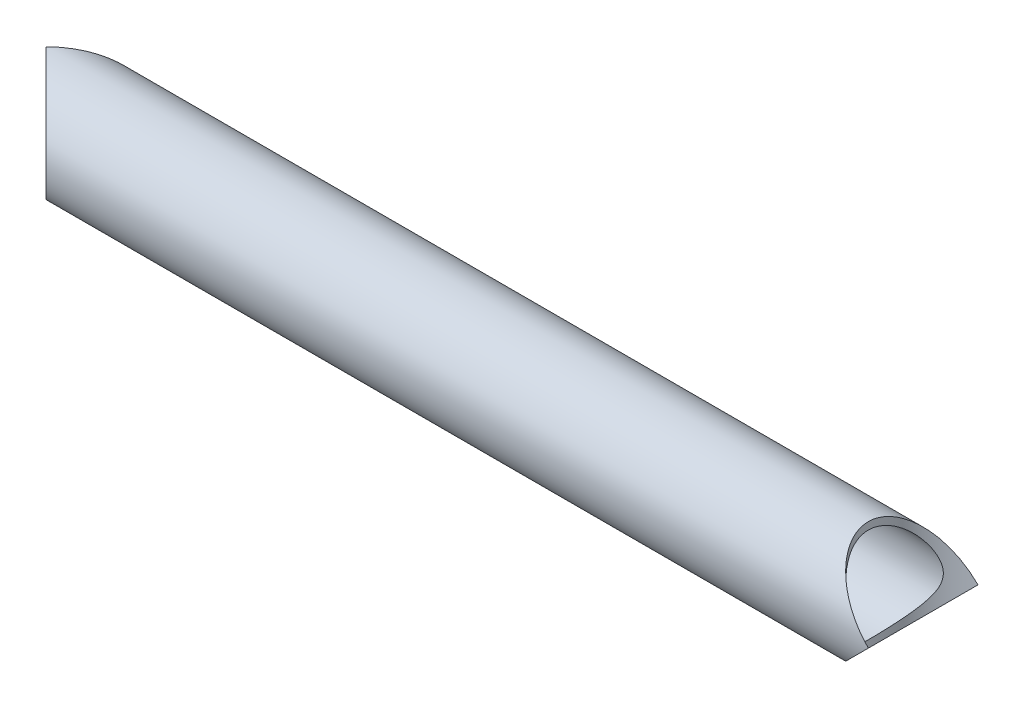
ISO-10303-21;
HEADER;
FILE_DESCRIPTION(('STEP AP214'),'2;1');
FILE_NAME('part.step','',(''),(''),'','','');
FILE_SCHEMA(('AUTOMOTIVE_DESIGN { 1 0 10303 214 1 1 1 1 }'));
ENDSEC;
DATA;
#1=APPLICATION_CONTEXT('core data for automotive mechanical design processes');
#2=APPLICATION_PROTOCOL_DEFINITION('international standard','automotive_design',2000,#1);
#3=PRODUCT_CONTEXT('',#1,'mechanical');
#4=PRODUCT('Part','Part','',(#3));
#5=PRODUCT_RELATED_PRODUCT_CATEGORY('part','',(#4));
#6=PRODUCT_DEFINITION_FORMATION('','',#4);
#7=PRODUCT_DEFINITION_CONTEXT('part definition',#1,'design');
#8=PRODUCT_DEFINITION('design','',#6,#7);
#9=PRODUCT_DEFINITION_SHAPE('','',#8);
#10=(LENGTH_UNIT() NAMED_UNIT(*) SI_UNIT(.MILLI.,.METRE.));
#11=(NAMED_UNIT(*) PLANE_ANGLE_UNIT() SI_UNIT($,.RADIAN.));
#12=(NAMED_UNIT(*) SI_UNIT($,.STERADIAN.) SOLID_ANGLE_UNIT());
#13=UNCERTAINTY_MEASURE_WITH_UNIT(LENGTH_MEASURE(1.E-05),#10,'distance_accuracy_value','');
#14=(GEOMETRIC_REPRESENTATION_CONTEXT(3) GLOBAL_UNCERTAINTY_ASSIGNED_CONTEXT((#13)) GLOBAL_UNIT_ASSIGNED_CONTEXT((#10,
#11,#12)) REPRESENTATION_CONTEXT('',''));
#15=CARTESIAN_POINT('',(0.,0.,0.));
#16=DIRECTION('',(0.,0.,1.));
#17=DIRECTION('',(1.,0.,0.));
#18=AXIS2_PLACEMENT_3D('',#15,#16,#17);
#19=CARTESIAN_POINT('',(0.,-50.8,-238.125));
#20=DIRECTION('',(0.,0.,1.));
#21=DIRECTION('',(1.,0.,0.));
#22=AXIS2_PLACEMENT_3D('',#19,#20,#21);
#23=CYLINDRICAL_SURFACE('',#22,9.52500000000001);
#24=CARTESIAN_POINT('',(0.,-50.8,0.));
#25=DIRECTION('',(0.707106781186547,0.,0.707106781186547));
#26=DIRECTION('',(0.707106781186547,0.,-0.707106781186547));
#27=AXIS2_PLACEMENT_3D('',#24,#25,#26);
#28=ELLIPSE('',#27,13.4703841816037,9.52500000000001);
#29=CARTESIAN_POINT('',(0.,-41.2749999999999,0.));
#30=VERTEX_POINT('',#29);
#31=CARTESIAN_POINT('',(0.,-60.325,0.));
#32=VERTEX_POINT('',#31);
#33=EDGE_CURVE('E52',#30,#32,#28,.F.);
#34=ORIENTED_EDGE('',*,*,#33,.T.);
#35=CARTESIAN_POINT('',(0.,-50.8,0.));
#36=DIRECTION('',(0.707106781186547,0.,-0.707106781186547));
#37=DIRECTION('',(0.707106781186547,0.,0.707106781186547));
#38=AXIS2_PLACEMENT_3D('',#35,#36,#37);
#39=ELLIPSE('',#38,13.4703841816037,9.52500000000001);
#40=EDGE_CURVE('E63',#32,#30,#39,.F.);
#41=ORIENTED_EDGE('',*,*,#40,.T.);
#42=EDGE_LOOP('',(#34,#41));
#43=FACE_BOUND('',#42,.T.);
#44=CARTESIAN_POINT('',(9.52500000000001,-50.8,-8.255));
#45=CARTESIAN_POINT('',(9.52499914862959,-50.9937491339826,-8.2549991309736));
#46=CARTESIAN_POINT('',(9.51907602387497,-51.1875106953685,-8.24816678082066));
#47=CARTESIAN_POINT('',(9.49551993069776,-51.5733685775466,-8.22096978778911));
#48=CARTESIAN_POINT('',(9.47788593013706,-51.765464750048,-8.20060395213657));
#49=CARTESIAN_POINT('',(9.43129946891756,-52.1465057541077,-8.14671669800961));
#50=CARTESIAN_POINT('',(9.40234100660183,-52.3354488591717,-8.11318830370017));
#51=CARTESIAN_POINT('',(9.33373426055015,-52.7086741908519,-8.03357968300137));
#52=CARTESIAN_POINT('',(9.29408596924615,-52.8929564141682,-7.98749944772571));
#53=CARTESIAN_POINT('',(9.20518387045818,-53.2545172542489,-7.883876820132));
#54=CARTESIAN_POINT('',(9.15599353806631,-53.4318333182141,-7.82641012090953));
#55=CARTESIAN_POINT('',(9.04871137350907,-53.7798704421834,-7.70062697305924));
#56=CARTESIAN_POINT('',(8.99061564825056,-53.9505885767598,-7.6323057787879));
#57=CARTESIAN_POINT('',(8.86648613376941,-54.2846518823356,-7.48568628536983));
#58=CARTESIAN_POINT('',(8.80045320628408,-54.4479978510829,-7.40738906925854));
#59=CARTESIAN_POINT('',(8.66139148346519,-54.7668875740141,-7.24162523096906));
#60=CARTESIAN_POINT('',(8.5883611564381,-54.9224296085534,-7.15415660082002));
#61=CARTESIAN_POINT('',(8.40705776916901,-55.283524955091,-6.93563606350434));
#62=CARTESIAN_POINT('',(8.29601262769741,-55.4853724282805,-6.80073731523924));
#63=CARTESIAN_POINT('',(8.06474384800302,-55.8731186214091,-6.51661799509541));
#64=CARTESIAN_POINT('',(7.94451695352177,-56.0590116330817,-6.36739233738681));
#65=CARTESIAN_POINT('',(7.69694275303353,-56.4151429764073,-6.0556854555986));
#66=CARTESIAN_POINT('',(7.56957931222033,-56.5853433270331,-5.89317377902937));
#67=CARTESIAN_POINT('',(7.31032763517805,-56.9096501257252,-5.55624676339446));
#68=CARTESIAN_POINT('',(7.17844000303209,-57.063758711384,-5.38183301047552));
#69=CARTESIAN_POINT('',(6.9097312609692,-57.3591094179562,-5.01788704155425));
#70=CARTESIAN_POINT('',(6.77286471020447,-57.5000133895365,-4.82811425764203));
#71=CARTESIAN_POINT('',(6.49972297017362,-57.7653046188988,-4.43682954916934));
#72=CARTESIAN_POINT('',(6.36344798637055,-57.889686522828,-4.23531384968978));
#73=CARTESIAN_POINT('',(6.09531136489426,-58.1214833005492,-3.8206332987035));
#74=CARTESIAN_POINT('',(5.96344127621442,-58.2289323330518,-3.60749309828611));
#75=CARTESIAN_POINT('',(5.7085576305259,-58.4265298507522,-3.16843181970327));
#76=CARTESIAN_POINT('',(5.58553712092029,-58.5166920120684,-2.94252102945843));
#77=CARTESIAN_POINT('',(5.3498744205718,-58.6820035814807,-2.4668144299831));
#78=CARTESIAN_POINT('',(5.23788214298114,-58.7563666632974,-2.21641466916653));
#79=CARTESIAN_POINT('',(5.04111943195074,-58.882480743163,-1.69963891728636));
#80=CARTESIAN_POINT('',(4.95629093434721,-58.9342800592027,-1.43329846759242));
#81=CARTESIAN_POINT('',(4.86390243338433,-58.9895732626365,-1.043940845343));
#82=CARTESIAN_POINT('',(4.83991842714102,-59.0037393928439,-0.92624014068879));
#83=CARTESIAN_POINT('',(4.80017344286407,-59.0270587846515,-0.688990887446993));
#84=CARTESIAN_POINT('',(4.78440857680632,-59.0362144165454,-0.569443240153893));
#85=CARTESIAN_POINT('',(4.76180407323102,-59.0493041993866,-0.329320339337236));
#86=CARTESIAN_POINT('',(4.75495666286147,-59.0532428976971,-0.208746073071848));
#87=CARTESIAN_POINT('',(4.7504847018737,-59.055817780715,0.0326338460710793));
#88=CARTESIAN_POINT('',(4.75286024879909,-59.0544539093416,0.153439501382323));
#89=CARTESIAN_POINT('',(4.76671281142104,-59.0464620880765,0.394165546022915));
#90=CARTESIAN_POINT('',(4.77817607905773,-59.0398420897208,0.514086996622097));
#91=CARTESIAN_POINT('',(4.80965247391356,-59.0215079052453,0.752426471254658));
#92=CARTESIAN_POINT('',(4.82966923600085,-59.0097915533559,0.87084383406029));
#93=CARTESIAN_POINT('',(4.90141020066711,-58.9673081803786,1.22310602414199));
#94=CARTESIAN_POINT('',(4.96481146964596,-58.9292140091403,1.453762928874));
#95=CARTESIAN_POINT('',(5.10130504482224,-58.8440993270653,1.86370727584944));
#96=CARTESIAN_POINT('',(5.17071608363497,-58.7998380394502,2.04487996617538));
#97=CARTESIAN_POINT('',(5.32095731682442,-58.7007056396117,2.39953345699076));
#98=CARTESIAN_POINT('',(5.40179537549818,-58.6458272107958,2.57300885110601));
#99=CARTESIAN_POINT('',(5.5717599521051,-58.5260571834298,2.91302040075877));
#100=CARTESIAN_POINT('',(5.66091424590649,-58.4611315145785,3.079530400691));
#101=CARTESIAN_POINT('',(5.84461572787502,-58.3219274665957,3.40543837179358));
#102=CARTESIAN_POINT('',(5.93916230476368,-58.2476501464354,3.56483714546802));
#103=CARTESIAN_POINT('',(6.18246639561227,-58.0483660051931,3.95950975045333));
#104=CARTESIAN_POINT('',(6.33346592764887,-57.9172954786953,4.19036061822696));
#105=CARTESIAN_POINT('',(6.63777489853477,-57.6343858364144,4.63747538270607));
#106=CARTESIAN_POINT('',(6.79108545677508,-57.4825363481922,4.85373191319801));
#107=CARTESIAN_POINT('',(7.09556835836765,-57.1582974388842,5.27132385376018));
#108=CARTESIAN_POINT('',(7.2467431523946,-56.9859341382319,5.47267772045501));
#109=CARTESIAN_POINT('',(7.54347617660779,-56.6203938688893,5.8599383863933));
#110=CARTESIAN_POINT('',(7.68903688542432,-56.4272262315866,6.04585204532023));
#111=CARTESIAN_POINT('',(7.93730120225226,-56.0688087289898,6.35820893639368));
#112=CARTESIAN_POINT('',(8.04190982332092,-55.9079764013749,6.48822041734577));
#113=CARTESIAN_POINT('',(8.24439807207301,-55.5742639895217,6.73756594349475));
#114=CARTESIAN_POINT('',(8.34227917360154,-55.4013865609079,6.8569023290983));
#115=CARTESIAN_POINT('',(8.52964066539298,-55.0439976026733,7.08366003651124));
#116=CARTESIAN_POINT('',(8.61913112474731,-54.8595004736176,7.19109566852855));
#117=CARTESIAN_POINT('',(8.78821213101059,-54.479162252312,7.39290924178351));
#118=CARTESIAN_POINT('',(8.86780452395289,-54.2833232853817,7.48728961825417));
#119=CARTESIAN_POINT('',(9.0023113415653,-53.9168967854233,7.64607452720222));
#120=CARTESIAN_POINT('',(9.0590973934159,-53.7480102549054,7.71282515872361));
#121=CARTESIAN_POINT('',(9.16395879695119,-53.4038113460863,7.83572387058536));
#122=CARTESIAN_POINT('',(9.21203596790863,-53.2285003190745,7.89187416542452));
#123=CARTESIAN_POINT('',(9.29862621941029,-52.8723757512166,7.99277926561642));
#124=CARTESIAN_POINT('',(9.33714258026418,-52.6915641215926,8.03753797954926));
#125=CARTESIAN_POINT('',(9.40388814271992,-52.325491254042,8.11497986008866));
#126=CARTESIAN_POINT('',(9.43211723199552,-52.1402299675534,8.14766289484147));
#127=CARTESIAN_POINT('',(9.47780652362302,-51.7656937772879,8.20051181828127));
#128=CARTESIAN_POINT('',(9.49521481683605,-51.5764039643053,8.22061737363727));
#129=CARTESIAN_POINT('',(9.5186628962909,-51.1961804933197,8.24768993736896));
#130=CARTESIAN_POINT('',(9.52470265693457,-51.0052468316163,8.25465691616096));
#131=CARTESIAN_POINT('',(9.52527587201026,-50.6233546852293,8.2553183095402));
#132=CARTESIAN_POINT('',(9.51981020342903,-50.4323962035471,8.24901373573471));
#133=CARTESIAN_POINT('',(9.49749861914189,-50.0520478152487,8.22325492565544));
#134=CARTESIAN_POINT('',(9.48065318813041,-49.8626578421735,8.20380124943697));
#135=CARTESIAN_POINT('',(9.43766380719513,-49.5012769873255,8.15408122776018));
#136=CARTESIAN_POINT('',(9.41232559052558,-49.3290593721157,8.12475103759835));
#137=CARTESIAN_POINT('',(9.35270884257685,-48.9882614282027,8.0556110496829));
#138=CARTESIAN_POINT('',(9.31842732431002,-48.8196823351416,8.01579775061749));
#139=CARTESIAN_POINT('',(9.24151845756409,-48.487193793368,7.92625943872891));
#140=CARTESIAN_POINT('',(9.19889358247869,-48.3232829771977,7.87653736329021));
#141=CARTESIAN_POINT('',(9.10593936756861,-48.0007724930908,7.76777500026871));
#142=CARTESIAN_POINT('',(9.05560715548276,-47.8421748321518,7.70873123855648));
#143=CARTESIAN_POINT('',(8.94374675295488,-47.5187608872484,7.5770251513239));
#144=CARTESIAN_POINT('',(8.88165097638803,-47.3544273551924,7.50365911320595));
#145=CARTESIAN_POINT('',(8.75025080214965,-47.033184711284,7.34765599089063));
#146=CARTESIAN_POINT('',(8.68094356792161,-46.8762785564935,7.26501525757012));
#147=CARTESIAN_POINT('',(8.46353025136191,-46.4172163199071,7.00428589271631));
#148=CARTESIAN_POINT('',(8.3059143565942,-46.1266651781981,6.81336884998671));
#149=CARTESIAN_POINT('',(8.01320461595646,-45.6450686935981,6.45283278047177));
#150=CARTESIAN_POINT('',(7.88192799380303,-45.4469871193798,6.28928934942972));
#151=CARTESIAN_POINT('',(7.61190373485766,-45.0695261386861,5.94739409172998));
#152=CARTESIAN_POINT('',(7.47315562111755,-44.8901479283049,5.76904131931227));
#153=CARTESIAN_POINT('',(7.19079436686111,-44.5496271092021,5.39827838667584));
#154=CARTESIAN_POINT('',(7.04717014783933,-44.3885302180035,5.20583488153893));
#155=CARTESIAN_POINT('',(6.7585161426583,-44.0849498277816,4.80788440247804));
#156=CARTESIAN_POINT('',(6.61348680090228,-43.9424606375919,4.60238145150814));
#157=CARTESIAN_POINT('',(6.35515925689204,-43.7033884965483,4.22170022153721));
#158=CARTESIAN_POINT('',(6.24145035992447,-43.603382572897,4.0489403447748));
#159=CARTESIAN_POINT('',(6.01768753522882,-43.4152581601178,3.69470620817141));
#160=CARTESIAN_POINT('',(5.90763428181514,-43.3271418550521,3.51323035552945));
#161=CARTESIAN_POINT('',(5.69440913102354,-43.1634210663693,3.14146809775938));
#162=CARTESIAN_POINT('',(5.5912203689602,-43.0877851878857,2.95120539019986));
#163=CARTESIAN_POINT('',(5.39540026708193,-42.9495457925735,2.5609115304039));
#164=CARTESIAN_POINT('',(5.30276149380796,-42.8869330736752,2.36088739974966));
#165=CARTESIAN_POINT('',(5.11946097161142,-42.7669061216854,1.91710109618568));
#166=CARTESIAN_POINT('',(5.03151344556333,-42.7119475490676,1.67147843973414));
#167=CARTESIAN_POINT('',(4.92337591366433,-42.6459951620064,1.29366079541493));
#168=CARTESIAN_POINT('',(4.8913087086469,-42.6267666085471,1.16625357807992));
#169=CARTESIAN_POINT('',(4.83638807525043,-42.5941487008162,0.908760812182177));
#170=CARTESIAN_POINT('',(4.81352969366666,-42.5807562071508,0.77867674311808));
#171=CARTESIAN_POINT('',(4.77793189106002,-42.560010368661,0.515053294315968));
#172=CARTESIAN_POINT('',(4.76531560533642,-42.5527304777701,0.381491235325643));
#173=CARTESIAN_POINT('',(4.75138012581388,-42.5446938925531,0.1135820800587));
#174=CARTESIAN_POINT('',(4.75006008842709,-42.5439367111202,-0.0207649568470562));
#175=CARTESIAN_POINT('',(4.75879767507656,-42.5489701458754,-0.289034938598511));
#176=CARTESIAN_POINT('',(4.76886169242112,-42.5547644413855,-0.422957602740212));
#177=CARTESIAN_POINT('',(4.79979015185113,-42.5727311374257,-0.689111683742179));
#178=CARTESIAN_POINT('',(4.82065637679742,-42.5849045908141,-0.821342817729457));
#179=CARTESIAN_POINT('',(4.87630241943855,-42.6177934044782,-1.10454643006358));
#180=CARTESIAN_POINT('',(4.91279727603148,-42.6395786354141,-1.25505528789721));
#181=CARTESIAN_POINT('',(4.99680884433471,-42.6907499928277,-1.55170325268707));
#182=CARTESIAN_POINT('',(5.04433452044921,-42.7201423035905,-1.69783869586886));
#183=CARTESIAN_POINT('',(5.14835522742285,-42.7860211217045,-1.98570912314558));
#184=CARTESIAN_POINT('',(5.20487665227994,-42.8225285783409,-2.1274296430917));
#185=CARTESIAN_POINT('',(5.32479592263952,-42.9020660574628,-2.40595811079114));
#186=CARTESIAN_POINT('',(5.38819222241243,-42.9450946146218,-2.54276715365905));
#187=CARTESIAN_POINT('',(5.56725013397191,-43.0701689501017,-2.90759118568059));
#188=CARTESIAN_POINT('',(5.68795470478587,-43.1581634331049,-3.13110425848448));
#189=CARTESIAN_POINT('',(5.93823193042168,-43.3509689832806,-3.56559758605928));
#190=CARTESIAN_POINT('',(6.06781063001082,-43.455791579878,-3.7765691114785));
#191=CARTESIAN_POINT('',(6.33146122219587,-43.6818241898935,-4.18706965610042));
#192=CARTESIAN_POINT('',(6.46553913594528,-43.8030568804667,-4.38658228698004));
#193=CARTESIAN_POINT('',(6.73454643258556,-44.0615785090047,-4.77419601105208));
#194=CARTESIAN_POINT('',(6.86947559839104,-44.198863498402,-4.96229989336767));
#195=CARTESIAN_POINT('',(7.14562965260799,-44.4984440958091,-5.33822587447616));
#196=CARTESIAN_POINT('',(7.28673552413452,-44.6617553119555,-5.52532860119201));
#197=CARTESIAN_POINT('',(7.56389432859166,-45.0067195135305,-5.88601693765025));
#198=CARTESIAN_POINT('',(7.6999462707097,-45.1883760698379,-6.05959990411039));
#199=CARTESIAN_POINT('',(7.96385928877277,-45.5696824243213,-6.39160103031028));
#200=CARTESIAN_POINT('',(8.09173780370978,-45.7692915660705,-6.55005185964254));
#201=CARTESIAN_POINT('',(8.33674937621361,-46.1866787251401,-6.8504254090725));
#202=CARTESIAN_POINT('',(8.4538873414714,-46.4044483566317,-6.99235568599348));
#203=CARTESIAN_POINT('',(8.64240803344512,-46.7917114334972,-7.21895608703129));
#204=CARTESIAN_POINT('',(8.71719498210357,-46.9568431547471,-7.3082800727298));
#205=CARTESIAN_POINT('',(8.85879069211986,-47.2955567207583,-7.47660654907039));
#206=CARTESIAN_POINT('',(8.92560141738879,-47.469136470562,-7.55561158090458));
#207=CARTESIAN_POINT('',(9.05010324269444,-47.8239988535158,-7.70228991439696));
#208=CARTESIAN_POINT('',(9.10780230457904,-48.0052745841023,-7.76997311226877));
#209=CARTESIAN_POINT('',(9.21308287307194,-48.3747956930314,-7.89311833522141));
#210=CARTESIAN_POINT('',(9.26066548891853,-48.5630403045965,-7.94858170019487));
#211=CARTESIAN_POINT('',(9.33887209356163,-48.9186537664878,-8.03955174193501));
#212=CARTESIAN_POINT('',(9.37093582182727,-49.0852716650071,-8.07676302214279));
#213=CARTESIAN_POINT('',(9.42633196678234,-49.4219587539794,-8.14097036810244));
#214=CARTESIAN_POINT('',(9.44966194236375,-49.592028895362,-8.16796357789892));
#215=CARTESIAN_POINT('',(9.48716109489852,-49.934511854833,-8.21131805296772));
#216=CARTESIAN_POINT('',(9.50133099798967,-50.1069244861208,-8.22768016098987));
#217=CARTESIAN_POINT('',(9.52024913405291,-50.4528883761126,-8.24951956226246));
#218=CARTESIAN_POINT('',(9.52500076265905,-50.6264392018054,-8.2550007784753));
#219=CARTESIAN_POINT('',(9.52500000000001,-50.8,-8.255));
#220=B_SPLINE_CURVE_WITH_KNOTS('',3,(#44,#45,#46,#47,#48,#49,#50,#51,#52,#53,#54,#55,#56,#57,
#58,#59,#60,#61,#62,#63,#64,#65,#66,#67,#68,#69,#70,#71,#72,#73,#74,#75,#76,#77,#78,#79,#80,#81,
#82,#83,#84,#85,#86,#87,#88,#89,#90,#91,#92,#93,#94,#95,#96,#97,#98,#99,#100,#101,#102,#103,
#104,#105,#106,#107,#108,#109,#110,#111,#112,#113,#114,#115,#116,#117,#118,#119,#120,#121,#122,
#123,#124,#125,#126,#127,#128,#129,#130,#131,#132,#133,#134,#135,#136,#137,#138,#139,#140,#141,
#142,#143,#144,#145,#146,#147,#148,#149,#150,#151,#152,#153,#154,#155,#156,#157,#158,#159,#160,
#161,#162,#163,#164,#165,#166,#167,#168,#169,#170,#171,#172,#173,#174,#175,#176,#177,#178,#179,
#180,#181,#182,#183,#184,#185,#186,#187,#188,#189,#190,#191,#192,#193,#194,#195,#196,#197,#198,
#199,#200,#201,#202,#203,#204,#205,#206,#207,#208,#209,#210,#211,#212,#213,#214,#215,#216,#217,
#218,#219),.UNSPECIFIED.,.T.,.F.,(4,2,2,2,2,2,2,2,2,2,2,2,2,2,2,2,2,2,2,2,2,2,2,2,2,2,2,2,2,2,2,
2,2,2,2,2,2,2,2,2,2,2,2,2,2,2,2,2,2,2,2,2,2,2,2,2,2,2,2,2,2,2,2,2,2,2,2,2,2,2,2,2,2,2,2,2,2,2,2,
2,2,2,2,2,2,2,2,4),(0.,0.581060302241168,1.16217182303357,1.74359173542285,2.3250120594397,
2.90268969124199,3.48062058537873,4.05848879048122,4.63648377810278,5.43621695420251,
6.23623508026263,7.03814127970887,7.83994081992868,8.65857780584581,9.47747942119573,
10.2947073130676,11.1112859813718,11.9620431912298,12.8109695269324,13.1734956172864,
13.5358500604877,13.8978884475344,14.2599306635729,14.6214262186982,14.9830755469358,
15.7069631447091,16.3031815010826,16.89981220255,17.498512307486,18.0971446771324,
19.0121600805805,19.9276339189251,20.8419543021521,21.7558662790184,22.4505614625091,
23.1451039659048,23.8388020282264,24.5323705181272,25.102627506706,25.6727652316906,
26.2427070714557,26.8126551342036,27.3853166471829,27.9579794496038,28.5305986031097,
29.1031933687764,29.6321866176357,30.1613567724987,30.6903702914558,31.2195814376324,
31.7901536941554,32.360951234249,33.5023725912858,34.3667872613037,35.2312571774338,
36.097843397763,36.9641639487798,37.6529096955542,38.3417817896671,39.0288936791848,
39.715518398605,40.512573766315,40.9105237639805,41.3082594272077,41.7107088469781,
42.1131282121321,42.5157736890733,42.9184856422249,43.38692566356,43.8557477127695,
44.3259715675199,44.7960899166667,45.6013224389748,46.4071090223581,47.2140207141776,
48.0207343366109,48.8767355197429,49.732903643882,50.5871794481831,51.441062941544,
52.0468024868874,52.6523925776822,53.2574505352096,53.862442115674,54.3830405578492,
54.9037844002805,55.4244869572118,55.9450017475653),.UNSPECIFIED.);
#221=CARTESIAN_POINT('',(9.52500000000001,-50.8,-8.255));
#222=VERTEX_POINT('',#221);
#223=EDGE_CURVE('E68',#222,#222,#220,.T.);
#224=ORIENTED_EDGE('',*,*,#223,.F.);
#225=EDGE_LOOP('',(#224));
#226=FACE_BOUND('',#225,.T.);
#227=ADVANCED_FACE('F33',(#43,#226),#23,.F.);
#228=CARTESIAN_POINT('',(152.4,-238.125,0.));
#229=DIRECTION('',(0.,1.,0.));
#230=DIRECTION('',(0.,0.,1.));
#231=AXIS2_PLACEMENT_3D('',#228,#229,#230);
#232=CYLINDRICAL_SURFACE('',#231,9.525);
#233=CARTESIAN_POINT('',(152.4,-50.8,0.));
#234=DIRECTION('',(0.707106781186547,0.707106781186547,0.));
#235=DIRECTION('',(0.707106781186547,-0.707106781186547,0.));
#236=AXIS2_PLACEMENT_3D('',#233,#234,#235);
#237=ELLIPSE('',#236,13.4703841816037,9.525);
#238=CARTESIAN_POINT('',(152.4,-50.8,-9.52499999999996));
#239=VERTEX_POINT('',#238);
#240=CARTESIAN_POINT('',(152.4,-50.7999999999999,9.52500000000002));
#241=VERTEX_POINT('',#240);
#242=EDGE_CURVE('E11',#239,#241,#237,.T.);
#243=ORIENTED_EDGE('',*,*,#242,.T.);
#244=CARTESIAN_POINT('',(152.4,-50.8,0.));
#245=DIRECTION('',(0.707106781186547,-0.707106781186547,0.));
#246=DIRECTION('',(0.707106781186547,0.707106781186547,0.));
#247=AXIS2_PLACEMENT_3D('',#244,#245,#246);
#248=ELLIPSE('',#247,13.4703841816037,9.525);
#249=EDGE_CURVE('E41',#241,#239,#248,.T.);
#250=ORIENTED_EDGE('',*,*,#249,.T.);
#251=EDGE_LOOP('',(#243,#250));
#252=FACE_BOUND('',#251,.T.);
#253=CARTESIAN_POINT('',(142.875,-42.545,0.));
#254=CARTESIAN_POINT('',(142.87500085137,-42.5450008690264,0.193749133982733));
#255=CARTESIAN_POINT('',(142.880923976125,-42.5518332191793,0.387510695368574));
#256=CARTESIAN_POINT('',(142.904480069302,-42.5790302122108,0.773368577546723));
#257=CARTESIAN_POINT('',(142.922114069863,-42.5993960478634,0.965464750048063));
#258=CARTESIAN_POINT('',(142.968700531082,-42.6532833019903,1.34650575410774));
#259=CARTESIAN_POINT('',(142.997658993398,-42.6868116962998,1.53544885917176));
#260=CARTESIAN_POINT('',(143.06626573945,-42.7664203169986,1.90867419085194));
#261=CARTESIAN_POINT('',(143.105914030754,-42.8125005522743,2.09295641416826));
#262=CARTESIAN_POINT('',(143.194816129542,-42.916123179868,2.454517254249));
#263=CARTESIAN_POINT('',(143.244006461934,-42.9735898790904,2.63183331821419));
#264=CARTESIAN_POINT('',(143.351288626491,-43.0993730269407,2.9798704421835));
#265=CARTESIAN_POINT('',(143.409384351749,-43.1676942212121,3.15058857675984));
#266=CARTESIAN_POINT('',(143.533513866231,-43.3143137146301,3.4846518823357));
#267=CARTESIAN_POINT('',(143.599546793716,-43.3926109307414,3.64799785108299));
#268=CARTESIAN_POINT('',(143.738608516535,-43.5583747690309,3.96688757401422));
#269=CARTESIAN_POINT('',(143.811638843562,-43.64584339918,4.12242960855345));
#270=CARTESIAN_POINT('',(143.992942230831,-43.8643639364956,4.48352495509111));
#271=CARTESIAN_POINT('',(144.103987372303,-43.9992626847607,4.68537242828058));
#272=CARTESIAN_POINT('',(144.335256151997,-44.2833820049046,5.07311862140915));
#273=CARTESIAN_POINT('',(144.455483046478,-44.4326076626132,5.25901163308178));
#274=CARTESIAN_POINT('',(144.703057246966,-44.7443145444014,5.61514297640733));
#275=CARTESIAN_POINT('',(144.83042068778,-44.9068262209706,5.78534332703317));
#276=CARTESIAN_POINT('',(145.089672364822,-45.2437532366055,6.10965012572531));
#277=CARTESIAN_POINT('',(145.221559996968,-45.4181669895245,6.26375871138408));
#278=CARTESIAN_POINT('',(145.490268739031,-45.7821129584457,6.5591094179563));
#279=CARTESIAN_POINT('',(145.627135289795,-45.9718857423579,6.70001338953653));
#280=CARTESIAN_POINT('',(145.900277029826,-46.3631704508306,6.96530461889882));
#281=CARTESIAN_POINT('',(146.036552013629,-46.5646861503102,7.08968652282803));
#282=CARTESIAN_POINT('',(146.304688635106,-46.9793667012965,7.32148330054928));
#283=CARTESIAN_POINT('',(146.436558723786,-47.1925069017139,7.42893233305185));
#284=CARTESIAN_POINT('',(146.691442369474,-47.6315681802967,7.62652985075223));
#285=CARTESIAN_POINT('',(146.81446287908,-47.8574789705416,7.71669201206844));
#286=CARTESIAN_POINT('',(147.050125579428,-48.3331855700169,7.88200358148075));
#287=CARTESIAN_POINT('',(147.162117857019,-48.5835853308335,7.95636666329746));
#288=CARTESIAN_POINT('',(147.358880568049,-49.1003610827136,8.08248074316305));
#289=CARTESIAN_POINT('',(147.443709065653,-49.3667015324076,8.13428005920272));
#290=CARTESIAN_POINT('',(147.536097566616,-49.756059154657,8.18957326263655));
#291=CARTESIAN_POINT('',(147.560081572859,-49.8737598593112,8.20373939284398));
#292=CARTESIAN_POINT('',(147.599826557136,-50.111009112553,8.22705878465156));
#293=CARTESIAN_POINT('',(147.615591423194,-50.2305567598461,8.23621441654547));
#294=CARTESIAN_POINT('',(147.638195926769,-50.4706796606628,8.2493041993867));
#295=CARTESIAN_POINT('',(147.645043337138,-50.5912539269282,8.25324289769713));
#296=CARTESIAN_POINT('',(147.649515298126,-50.8326338460711,8.25581778071505));
#297=CARTESIAN_POINT('',(147.647139751201,-50.9534395013824,8.25445390934165));
#298=CARTESIAN_POINT('',(147.633287188579,-51.194165546023,8.24646208807653));
#299=CARTESIAN_POINT('',(147.621823920942,-51.3140869966221,8.23984208972089));
#300=CARTESIAN_POINT('',(147.590347526086,-51.5524264712547,8.22150790524537));
#301=CARTESIAN_POINT('',(147.570330763999,-51.6708438340603,8.20979155335592));
#302=CARTESIAN_POINT('',(147.498589799333,-52.0231060241421,8.1673081803786));
#303=CARTESIAN_POINT('',(147.435188530354,-52.2537629288741,8.12921400914038));
#304=CARTESIAN_POINT('',(147.298694955178,-52.6637072758495,8.0440993270653));
#305=CARTESIAN_POINT('',(147.229283916365,-52.8448799661755,7.99983803945018));
#306=CARTESIAN_POINT('',(147.079042683175,-53.1995334569908,7.90070563961168));
#307=CARTESIAN_POINT('',(146.998204624502,-53.3730088511061,7.84582721079578));
#308=CARTESIAN_POINT('',(146.828240047895,-53.7130204007589,7.72605718342984));
#309=CARTESIAN_POINT('',(146.739085754093,-53.8795304006911,7.66113151457847));
#310=CARTESIAN_POINT('',(146.555384272125,-54.2054383717937,7.52192746659572));
#311=CARTESIAN_POINT('',(146.460837695236,-54.3648371454681,7.44765014643539));
#312=CARTESIAN_POINT('',(146.217533604388,-54.7595097504534,7.24836600519301));
#313=CARTESIAN_POINT('',(146.066534072351,-54.9903606182271,7.11729547869526));
#314=CARTESIAN_POINT('',(145.762225101465,-55.4374753827062,6.8343858364144));
#315=CARTESIAN_POINT('',(145.608914543225,-55.6537319131981,6.68253634819218));
#316=CARTESIAN_POINT('',(145.304431641632,-56.0713238537603,6.35829743888409));
#317=CARTESIAN_POINT('',(145.153256847605,-56.2726777204551,6.18593413823184));
#318=CARTESIAN_POINT('',(144.856523823392,-56.6599383863934,5.82039386888923));
#319=CARTESIAN_POINT('',(144.710963114576,-56.8458520453203,5.62722623158655));
#320=CARTESIAN_POINT('',(144.462698797748,-57.1582089363937,5.26880872898972));
#321=CARTESIAN_POINT('',(144.358090176679,-57.2882204173458,5.10797640137478));
#322=CARTESIAN_POINT('',(144.155601927927,-57.5375659434948,4.77426398952159));
#323=CARTESIAN_POINT('',(144.057720826398,-57.6569023290984,4.6013865609078));
#324=CARTESIAN_POINT('',(143.870359334607,-57.8836600365113,4.24399760267324));
#325=CARTESIAN_POINT('',(143.780868875253,-57.9910956685286,4.05950047361751));
#326=CARTESIAN_POINT('',(143.611787868989,-58.1929092417835,3.67916225231196));
#327=CARTESIAN_POINT('',(143.532195476047,-58.2872896182542,3.48332328538161));
#328=CARTESIAN_POINT('',(143.397688658435,-58.4460745272022,3.1168967854232));
#329=CARTESIAN_POINT('',(143.340902606584,-58.5128251587236,2.94801025490533));
#330=CARTESIAN_POINT('',(143.236041203049,-58.6357238705854,2.60381134608626));
#331=CARTESIAN_POINT('',(143.187964032091,-58.6918741654245,2.42850031907444));
#332=CARTESIAN_POINT('',(143.10137378059,-58.7927792656164,2.07237575121655));
#333=CARTESIAN_POINT('',(143.062857419736,-58.8375379795492,1.89156412159253));
#334=CARTESIAN_POINT('',(142.99611185728,-58.9149798600886,1.52549125404195));
#335=CARTESIAN_POINT('',(142.967882768004,-58.9476628948414,1.34022996755333));
#336=CARTESIAN_POINT('',(142.922193476377,-59.0005118182812,0.965693777287863));
#337=CARTESIAN_POINT('',(142.904785183164,-59.0206173736372,0.776403964305255));
#338=CARTESIAN_POINT('',(142.881337103709,-59.0476899373689,0.396180493319657));
#339=CARTESIAN_POINT('',(142.875297343065,-59.0546569161609,0.205246831616239));
#340=CARTESIAN_POINT('',(142.87472412799,-59.0553183095402,-0.176645314770721));
#341=CARTESIAN_POINT('',(142.880189796571,-59.0490137357347,-0.367603796452976));
#342=CARTESIAN_POINT('',(142.902501380858,-59.0232549256554,-0.747952184751292));
#343=CARTESIAN_POINT('',(142.91934681187,-59.0038012494369,-0.937342157826555));
#344=CARTESIAN_POINT('',(142.962336192805,-58.9540812277601,-1.2987230126745));
#345=CARTESIAN_POINT('',(142.987674409474,-58.9247510375983,-1.47094062788431));
#346=CARTESIAN_POINT('',(143.047291157423,-58.8556110496828,-1.81173857179738));
#347=CARTESIAN_POINT('',(143.08157267569,-58.8157977506174,-1.98031766485846));
#348=CARTESIAN_POINT('',(143.158481542436,-58.7262594387288,-2.31280620663204));
#349=CARTESIAN_POINT('',(143.201106417521,-58.6765373632901,-2.47671702280235));
#350=CARTESIAN_POINT('',(143.294060632431,-58.5677750002686,-2.79922750690918));
#351=CARTESIAN_POINT('',(143.344392844517,-58.5087312385564,-2.95782516784818));
#352=CARTESIAN_POINT('',(143.456253247045,-58.3770251513238,-3.28123911275159));
#353=CARTESIAN_POINT('',(143.518349023612,-58.3036591132059,-3.44557264480762));
#354=CARTESIAN_POINT('',(143.64974919785,-58.1476559908905,-3.766815288716));
#355=CARTESIAN_POINT('',(143.719056432079,-58.06501525757,-3.92372144350653));
#356=CARTESIAN_POINT('',(143.936469748638,-57.8042858927162,-4.38278368009289));
#357=CARTESIAN_POINT('',(144.094085643406,-57.6133688499866,-4.67333482180193));
#358=CARTESIAN_POINT('',(144.386795384044,-57.2528327804717,-5.15493130640191));
#359=CARTESIAN_POINT('',(144.518072006197,-57.0892893494296,-5.35301288062019));
#360=CARTESIAN_POINT('',(144.788096265142,-56.7473940917299,-5.73047386131395));
#361=CARTESIAN_POINT('',(144.926844378883,-56.5690413193122,-5.90985207169514));
#362=CARTESIAN_POINT('',(145.209205633139,-56.1982783866757,-6.2503728907979));
#363=CARTESIAN_POINT('',(145.352829852161,-56.0058348815388,-6.41146978199648));
#364=CARTESIAN_POINT('',(145.641483857342,-55.6078844024779,-6.7150501722184));
#365=CARTESIAN_POINT('',(145.786513199098,-55.402381451508,-6.85753936240812));
#366=CARTESIAN_POINT('',(146.044840743108,-55.0217002215371,-7.09661150345166));
#367=CARTESIAN_POINT('',(146.158549640076,-54.8489403447747,-7.19661742710294));
#368=CARTESIAN_POINT('',(146.382312464771,-54.4947062081713,-7.38474183988222));
#369=CARTESIAN_POINT('',(146.492365718185,-54.3132303555294,-7.47285814494789));
#370=CARTESIAN_POINT('',(146.705590868977,-53.9414680977593,-7.63657893363068));
#371=CARTESIAN_POINT('',(146.80877963104,-53.7512053901998,-7.71221481211431));
#372=CARTESIAN_POINT('',(147.004599732918,-53.3609115304038,-7.85045420742642));
#373=CARTESIAN_POINT('',(147.097238506192,-53.1608873997496,-7.91306692632472));
#374=CARTESIAN_POINT('',(147.280539028389,-52.7171010961856,-8.03309387831454));
#375=CARTESIAN_POINT('',(147.368486554437,-52.4714784397341,-8.08805245093232));
#376=CARTESIAN_POINT('',(147.476624086336,-52.0936607954149,-8.15400483799359));
#377=CARTESIAN_POINT('',(147.508691291353,-51.9662535780799,-8.17323339145289));
#378=CARTESIAN_POINT('',(147.56361192475,-51.7087608121821,-8.20585129918379));
#379=CARTESIAN_POINT('',(147.586470306334,-51.5786767431181,-8.21924379284914));
#380=CARTESIAN_POINT('',(147.62206810894,-51.315053294316,-8.23998963133893));
#381=CARTESIAN_POINT('',(147.634684394664,-51.1814912353256,-8.24726952222986));
#382=CARTESIAN_POINT('',(147.648619874186,-50.9135820800587,-8.25530610744689));
#383=CARTESIAN_POINT('',(147.649939911573,-50.779235043153,-8.25606328887974));
#384=CARTESIAN_POINT('',(147.641202324924,-50.5109650614015,-8.25102985412451));
#385=CARTESIAN_POINT('',(147.631138307579,-50.3770423972598,-8.24523555861445));
#386=CARTESIAN_POINT('',(147.600209848149,-50.1108883162578,-8.2272688625743));
#387=CARTESIAN_POINT('',(147.579343623203,-49.9786571822706,-8.21509540918585));
#388=CARTESIAN_POINT('',(147.523697580562,-49.6954535699364,-8.18220659552175));
#389=CARTESIAN_POINT('',(147.487202723969,-49.5449447121028,-8.16042136458584));
#390=CARTESIAN_POINT('',(147.403191155665,-49.248296747313,-8.10925000717227));
#391=CARTESIAN_POINT('',(147.355665479551,-49.1021613041312,-8.0798576964095));
#392=CARTESIAN_POINT('',(147.251644772577,-48.8142908768545,-8.01397887829547));
#393=CARTESIAN_POINT('',(147.19512334772,-48.6725703569084,-7.9774714216591));
#394=CARTESIAN_POINT('',(147.075204077361,-48.3940418892089,-7.89793394253724));
#395=CARTESIAN_POINT('',(147.011807777588,-48.257232846341,-7.85490538537823));
#396=CARTESIAN_POINT('',(146.832749866028,-47.8924088143195,-7.72983104989833));
#397=CARTESIAN_POINT('',(146.712045295214,-47.6688957415156,-7.64183656689508));
#398=CARTESIAN_POINT('',(146.461768069579,-47.2344024139408,-7.44903101671946));
#399=CARTESIAN_POINT('',(146.332189369989,-47.0234308885216,-7.34420842012201));
#400=CARTESIAN_POINT('',(146.068538777804,-46.6129303438997,-7.11817581010659));
#401=CARTESIAN_POINT('',(145.934460864055,-46.4134177130201,-6.99694311953338));
#402=CARTESIAN_POINT('',(145.665453567415,-46.025803988948,-6.73842149099536));
#403=CARTESIAN_POINT('',(145.530524401609,-45.8377001066324,-6.6011365015981));
#404=CARTESIAN_POINT('',(145.254370347392,-45.461774125524,-6.30155590419095));
#405=CARTESIAN_POINT('',(145.113264475866,-45.2746713988081,-6.13824468804457));
#406=CARTESIAN_POINT('',(144.836105671409,-44.9139830623499,-5.7932804864696));
#407=CARTESIAN_POINT('',(144.700053729291,-44.7404000958897,-5.61162393016226));
#408=CARTESIAN_POINT('',(144.436140711227,-44.4083989696898,-5.23031757567885));
#409=CARTESIAN_POINT('',(144.30826219629,-44.2499481403576,-5.03070843392964));
#410=CARTESIAN_POINT('',(144.063250623787,-43.9495745909276,-4.61332127486006));
#411=CARTESIAN_POINT('',(143.946112658529,-43.8076443140066,-4.39555164336844));
#412=CARTESIAN_POINT('',(143.757591966555,-43.5810439129688,-4.008288566503));
#413=CARTESIAN_POINT('',(143.682805017897,-43.4917199272703,-3.84315684525308));
#414=CARTESIAN_POINT('',(143.54120930788,-43.3233934509297,-3.50444327924189));
#415=CARTESIAN_POINT('',(143.474398582611,-43.2443884190955,-3.33086352943816));
#416=CARTESIAN_POINT('',(143.349896757306,-43.0977100856031,-2.9760011464844));
#417=CARTESIAN_POINT('',(143.292197695421,-43.0300268877313,-2.79472541589785));
#418=CARTESIAN_POINT('',(143.186917126928,-42.9068816647786,-2.42520430696879));
#419=CARTESIAN_POINT('',(143.139334511082,-42.8514182998052,-2.23695969540365));
#420=CARTESIAN_POINT('',(143.061127906438,-42.760448258065,-1.8813462335124));
#421=CARTESIAN_POINT('',(143.029064178173,-42.7232369778572,-1.71472833499303));
#422=CARTESIAN_POINT('',(142.973668033218,-42.6590296318975,-1.37804124602066));
#423=CARTESIAN_POINT('',(142.950338057636,-42.6320364221011,-1.20797110463807));
#424=CARTESIAN_POINT('',(142.912838905101,-42.5886819470322,-0.865488145167055));
#425=CARTESIAN_POINT('',(142.89866900201,-42.5723198390101,-0.693075513879207));
#426=CARTESIAN_POINT('',(142.879750865947,-42.5504804377375,-0.347111623887326));
#427=CARTESIAN_POINT('',(142.874999237341,-42.5449992215247,-0.173560798194559));
#428=CARTESIAN_POINT('',(142.875,-42.545,0.));
#429=B_SPLINE_CURVE_WITH_KNOTS('',3,(#253,#254,#255,#256,#257,#258,#259,#260,#261,#262,#263,
#264,#265,#266,#267,#268,#269,#270,#271,#272,#273,#274,#275,#276,#277,#278,#279,#280,#281,#282,
#283,#284,#285,#286,#287,#288,#289,#290,#291,#292,#293,#294,#295,#296,#297,#298,#299,#300,#301,
#302,#303,#304,#305,#306,#307,#308,#309,#310,#311,#312,#313,#314,#315,#316,#317,#318,#319,#320,
#321,#322,#323,#324,#325,#326,#327,#328,#329,#330,#331,#332,#333,#334,#335,#336,#337,#338,#339,
#340,#341,#342,#343,#344,#345,#346,#347,#348,#349,#350,#351,#352,#353,#354,#355,#356,#357,#358,
#359,#360,#361,#362,#363,#364,#365,#366,#367,#368,#369,#370,#371,#372,#373,#374,#375,#376,#377,
#378,#379,#380,#381,#382,#383,#384,#385,#386,#387,#388,#389,#390,#391,#392,#393,#394,#395,#396,
#397,#398,#399,#400,#401,#402,#403,#404,#405,#406,#407,#408,#409,#410,#411,#412,#413,#414,#415,
#416,#417,#418,#419,#420,#421,#422,#423,#424,#425,#426,#427,#428),.UNSPECIFIED.,.T.,.F.,(4,2,2,
2,2,2,2,2,2,2,2,2,2,2,2,2,2,2,2,2,2,2,2,2,2,2,2,2,2,2,2,2,2,2,2,2,2,2,2,2,2,2,2,2,2,2,2,2,2,2,2,
2,2,2,2,2,2,2,2,2,2,2,2,2,2,2,2,2,2,2,2,2,2,2,2,2,2,2,2,2,2,2,2,2,2,2,2,4),(0.,
0.581060302241171,1.16217182303357,1.74359173542286,2.3250120594397,2.90268969124199,
3.48062058537873,4.0584887904812,4.63648377810276,5.4362169542025,6.2362350802626,
7.03814127970885,7.83994081992866,8.65857780584578,9.47747942119569,10.2947073130676,
11.1112859813718,11.9620431912298,12.8109695269324,13.1734956172864,13.5358500604877,
13.8978884475344,14.2599306635729,14.6214262186983,14.9830755469358,15.7069631447092,
16.3031815010827,16.8998122025501,17.4985123074861,18.0971446771325,19.0121600805806,
19.9276339189253,20.8419543021523,21.7558662790186,22.4505614625092,23.1451039659048,
23.8388020282265,24.5323705181272,25.102627506706,25.6727652316906,26.2427070714557,
26.8126551342036,27.3853166471829,27.9579794496038,28.5305986031097,29.1031933687764,
29.6321866176357,30.1613567724987,30.6903702914558,31.2195814376324,31.7901536941554,
32.360951234249,33.5023725912858,34.3667872613037,35.2312571774338,36.0978433977631,
36.9641639487799,37.6529096955542,38.341781789667,39.0288936791848,39.7155183986049,
40.5125737663149,40.9105237639804,41.3082594272076,41.710708846978,42.113128212132,
42.5157736890732,42.9184856422248,43.3869256635599,43.8557477127694,44.3259715675198,
44.7960899166665,45.6013224389746,46.4071090223579,47.2140207141774,48.0207343366107,
48.8767355197426,49.7329036438817,50.5871794481828,51.4410629415438,52.0468024868872,
52.652392577682,53.2574505352094,53.8624421156738,54.3830405578491,54.9037844002804,
55.4244869572118,55.9450017475653),.UNSPECIFIED.);
#430=CARTESIAN_POINT('',(142.875,-42.545,0.));
#431=VERTEX_POINT('',#430);
#432=EDGE_CURVE('E65',#431,#431,#429,.T.);
#433=ORIENTED_EDGE('',*,*,#432,.F.);
#434=EDGE_LOOP('',(#433));
#435=FACE_BOUND('',#434,.T.);
#436=ADVANCED_FACE('F57',(#252,#435),#232,.F.);
#437=CARTESIAN_POINT('',(0.,-50.7999999999999,0.));
#438=DIRECTION('',(1.,0.,0.));
#439=DIRECTION('',(0.,1.,0.));
#440=AXIS2_PLACEMENT_3D('',#437,#438,#439);
#441=CYLINDRICAL_SURFACE('',#440,9.525);
#442=ORIENTED_EDGE('',*,*,#242,.F.);
#443=ORIENTED_EDGE('',*,*,#249,.F.);
#444=EDGE_LOOP('',(#442,#443));
#445=FACE_BOUND('',#444,.T.);
#446=ORIENTED_EDGE('',*,*,#33,.F.);
#447=ORIENTED_EDGE('',*,*,#40,.F.);
#448=EDGE_LOOP('',(#446,#447));
#449=FACE_BOUND('',#448,.T.);
#450=ADVANCED_FACE('F35',(#445,#449),#441,.T.);
#451=CARTESIAN_POINT('',(0.,-50.7999999999999,0.));
#452=DIRECTION('',(1.,0.,0.));
#453=DIRECTION('',(0.,1.,0.));
#454=AXIS2_PLACEMENT_3D('',#451,#452,#453);
#455=CYLINDRICAL_SURFACE('',#454,8.255);
#456=ORIENTED_EDGE('',*,*,#432,.T.);
#457=EDGE_LOOP('',(#456));
#458=FACE_BOUND('',#457,.T.);
#459=ORIENTED_EDGE('',*,*,#223,.T.);
#460=EDGE_LOOP('',(#459));
#461=FACE_BOUND('',#460,.T.);
#462=ADVANCED_FACE('F62',(#458,#461),#455,.F.);
#463=CLOSED_SHELL('',(#227,#436,#450,#462));
#464=MANIFOLD_SOLID_BREP('B2',#463);
#465=ADVANCED_BREP_SHAPE_REPRESENTATION('',(#18,#464),#14);
#466=SHAPE_DEFINITION_REPRESENTATION(#9,#465);
ENDSEC;
END-ISO-10303-21;
